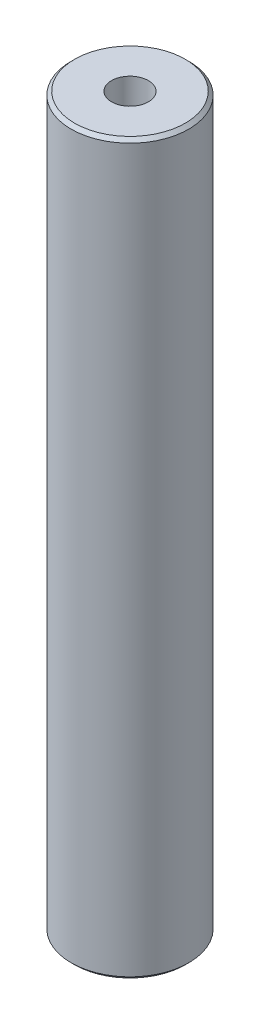
ISO-10303-21;
HEADER;
FILE_DESCRIPTION(('STEP AP214'),'2;1');
FILE_NAME('part.step','',(''),(''),'','','');
FILE_SCHEMA(('AUTOMOTIVE_DESIGN { 1 0 10303 214 1 1 1 1 }'));
ENDSEC;
DATA;
#1=APPLICATION_CONTEXT('core data for automotive mechanical design processes');
#2=APPLICATION_PROTOCOL_DEFINITION('international standard','automotive_design',2000,#1);
#3=PRODUCT_CONTEXT('',#1,'mechanical');
#4=PRODUCT('Part','Part','',(#3));
#5=PRODUCT_RELATED_PRODUCT_CATEGORY('part','',(#4));
#6=PRODUCT_DEFINITION_FORMATION('','',#4);
#7=PRODUCT_DEFINITION_CONTEXT('part definition',#1,'design');
#8=PRODUCT_DEFINITION('design','',#6,#7);
#9=PRODUCT_DEFINITION_SHAPE('','',#8);
#10=(LENGTH_UNIT() NAMED_UNIT(*) SI_UNIT(.MILLI.,.METRE.));
#11=(NAMED_UNIT(*) PLANE_ANGLE_UNIT() SI_UNIT($,.RADIAN.));
#12=(NAMED_UNIT(*) SI_UNIT($,.STERADIAN.) SOLID_ANGLE_UNIT());
#13=UNCERTAINTY_MEASURE_WITH_UNIT(LENGTH_MEASURE(1.E-05),#10,'distance_accuracy_value','');
#14=(GEOMETRIC_REPRESENTATION_CONTEXT(3) GLOBAL_UNCERTAINTY_ASSIGNED_CONTEXT((#13)) GLOBAL_UNIT_ASSIGNED_CONTEXT((#10,
#11,#12)) REPRESENTATION_CONTEXT('',''));
#15=CARTESIAN_POINT('',(0.,0.,0.));
#16=DIRECTION('',(0.,0.,1.));
#17=DIRECTION('',(1.,0.,0.));
#18=AXIS2_PLACEMENT_3D('',#15,#16,#17);
#19=CARTESIAN_POINT('',(0.,433.654676847622,0.));
#20=DIRECTION('',(0.,-1.,0.));
#21=DIRECTION('',(0.,0.,-1.));
#22=AXIS2_PLACEMENT_3D('',#19,#20,#21);
#23=CYLINDRICAL_SURFACE('',#22,35.);
#24=CARTESIAN_POINT('',(0.,431.602640914399,0.));
#25=DIRECTION('',(0.,1.,0.));
#26=DIRECTION('',(0.,0.,1.));
#27=AXIS2_PLACEMENT_3D('',#24,#25,#26);
#28=CIRCLE('',#27,35.);
#29=CARTESIAN_POINT('',(0.,431.602640914399,35.));
#30=VERTEX_POINT('',#29);
#31=EDGE_CURVE('E50',#30,#30,#28,.F.);
#32=ORIENTED_EDGE('',*,*,#31,.T.);
#33=EDGE_LOOP('',(#32));
#34=FACE_BOUND('',#33,.T.);
#35=CARTESIAN_POINT('',(0.,2.05203593322323,0.));
#36=DIRECTION('',(0.,1.,0.));
#37=DIRECTION('',(0.,0.,1.));
#38=AXIS2_PLACEMENT_3D('',#35,#36,#37);
#39=CIRCLE('',#38,35.);
#40=CARTESIAN_POINT('',(0.,2.05203593322323,35.));
#41=VERTEX_POINT('',#40);
#42=EDGE_CURVE('E51',#41,#41,#39,.T.);
#43=ORIENTED_EDGE('',*,*,#42,.T.);
#44=EDGE_LOOP('',(#43));
#45=FACE_BOUND('',#44,.T.);
#46=ADVANCED_FACE('F39',(#34,#45),#23,.T.);
#47=CARTESIAN_POINT('',(0.,433.654676847622,0.));
#48=DIRECTION('',(0.,1.,0.));
#49=DIRECTION('',(0.,0.,1.));
#50=AXIS2_PLACEMENT_3D('',#47,#48,#49);
#51=PLANE('',#50);
#52=CARTESIAN_POINT('',(0.,433.654676847622,0.));
#53=DIRECTION('',(0.,1.,0.));
#54=DIRECTION('',(0.,0.,1.));
#55=AXIS2_PLACEMENT_3D('',#52,#53,#54);
#56=CIRCLE('',#55,32.9479640667767);
#57=CARTESIAN_POINT('',(0.,433.654676847622,32.9479640667767));
#58=VERTEX_POINT('',#57);
#59=EDGE_CURVE('E54',#58,#58,#56,.T.);
#60=ORIENTED_EDGE('',*,*,#59,.T.);
#61=EDGE_LOOP('',(#60));
#62=FACE_BOUND('',#61,.T.);
#63=CARTESIAN_POINT('',(0.,433.654676847622,0.));
#64=DIRECTION('',(0.,1.,0.));
#65=DIRECTION('',(0.,0.,1.));
#66=AXIS2_PLACEMENT_3D('',#63,#64,#65);
#67=CIRCLE('',#66,10.9717333855831);
#68=CARTESIAN_POINT('',(0.,433.654676847622,10.9717333855831));
#69=VERTEX_POINT('',#68);
#70=EDGE_CURVE('E58',#69,#69,#67,.T.);
#71=ORIENTED_EDGE('',*,*,#70,.F.);
#72=EDGE_LOOP('',(#71));
#73=FACE_BOUND('',#72,.T.);
#74=ADVANCED_FACE('F69',(#62,#73),#51,.T.);
#75=CARTESIAN_POINT('',(0.,0.,0.));
#76=DIRECTION('',(0.,1.,0.));
#77=DIRECTION('',(0.,0.,1.));
#78=AXIS2_PLACEMENT_3D('',#75,#76,#77);
#79=PLANE('',#78);
#80=CARTESIAN_POINT('',(0.,0.,0.));
#81=DIRECTION('',(0.,1.,0.));
#82=DIRECTION('',(0.,0.,1.));
#83=AXIS2_PLACEMENT_3D('',#80,#81,#82);
#84=CIRCLE('',#83,32.9479640667767);
#85=CARTESIAN_POINT('',(0.,0.,32.9479640667767));
#86=VERTEX_POINT('',#85);
#87=EDGE_CURVE('E10',#86,#86,#84,.F.);
#88=ORIENTED_EDGE('',*,*,#87,.T.);
#89=EDGE_LOOP('',(#88));
#90=FACE_BOUND('',#89,.T.);
#91=CARTESIAN_POINT('',(0.,0.,0.));
#92=DIRECTION('',(0.,1.,0.));
#93=DIRECTION('',(0.,0.,1.));
#94=AXIS2_PLACEMENT_3D('',#91,#92,#93);
#95=CIRCLE('',#94,10.9717333855831);
#96=CARTESIAN_POINT('',(0.,0.,10.9717333855831));
#97=VERTEX_POINT('',#96);
#98=EDGE_CURVE('E63',#97,#97,#95,.T.);
#99=ORIENTED_EDGE('',*,*,#98,.T.);
#100=EDGE_LOOP('',(#99));
#101=FACE_BOUND('',#100,.T.);
#102=ADVANCED_FACE('F75',(#90,#101),#79,.F.);
#103=CARTESIAN_POINT('',(0.,433.654676847622,0.));
#104=DIRECTION('',(0.,-1.,0.));
#105=DIRECTION('',(0.,0.,-1.));
#106=AXIS2_PLACEMENT_3D('',#103,#104,#105);
#107=CYLINDRICAL_SURFACE('',#106,10.9717333855831);
#108=ORIENTED_EDGE('',*,*,#70,.T.);
#109=EDGE_LOOP('',(#108));
#110=FACE_BOUND('',#109,.T.);
#111=ORIENTED_EDGE('',*,*,#98,.F.);
#112=EDGE_LOOP('',(#111));
#113=FACE_BOUND('',#112,.T.);
#114=ADVANCED_FACE('F70',(#110,#113),#107,.F.);
#115=CARTESIAN_POINT('',(0.,433.654676847622,0.));
#116=DIRECTION('',(0.,-1.,0.));
#117=DIRECTION('',(0.,0.,-1.));
#118=AXIS2_PLACEMENT_3D('',#115,#116,#117);
#119=CONICAL_SURFACE('',#118,32.9479640667767,0.785398163397443);
#120=ORIENTED_EDGE('',*,*,#31,.F.);
#121=EDGE_LOOP('',(#120));
#122=FACE_BOUND('',#121,.T.);
#123=ORIENTED_EDGE('',*,*,#59,.F.);
#124=EDGE_LOOP('',(#123));
#125=FACE_BOUND('',#124,.T.);
#126=ADVANCED_FACE('F81',(#122,#125),#119,.T.);
#127=CARTESIAN_POINT('',(0.,2.05203593322323,0.));
#128=DIRECTION('',(0.,1.,0.));
#129=DIRECTION('',(0.,0.,1.));
#130=AXIS2_PLACEMENT_3D('',#127,#128,#129);
#131=CONICAL_SURFACE('',#130,35.,0.785398163397457);
#132=ORIENTED_EDGE('',*,*,#87,.F.);
#133=EDGE_LOOP('',(#132));
#134=FACE_BOUND('',#133,.T.);
#135=ORIENTED_EDGE('',*,*,#42,.F.);
#136=EDGE_LOOP('',(#135));
#137=FACE_BOUND('',#136,.T.);
#138=ADVANCED_FACE('F45',(#134,#137),#131,.T.);
#139=CLOSED_SHELL('',(#46,#74,#102,#114,#126,#138));
#140=MANIFOLD_SOLID_BREP('B2',#139);
#141=ADVANCED_BREP_SHAPE_REPRESENTATION('',(#18,#140),#14);
#142=SHAPE_DEFINITION_REPRESENTATION(#9,#141);
ENDSEC;
END-ISO-10303-21;
